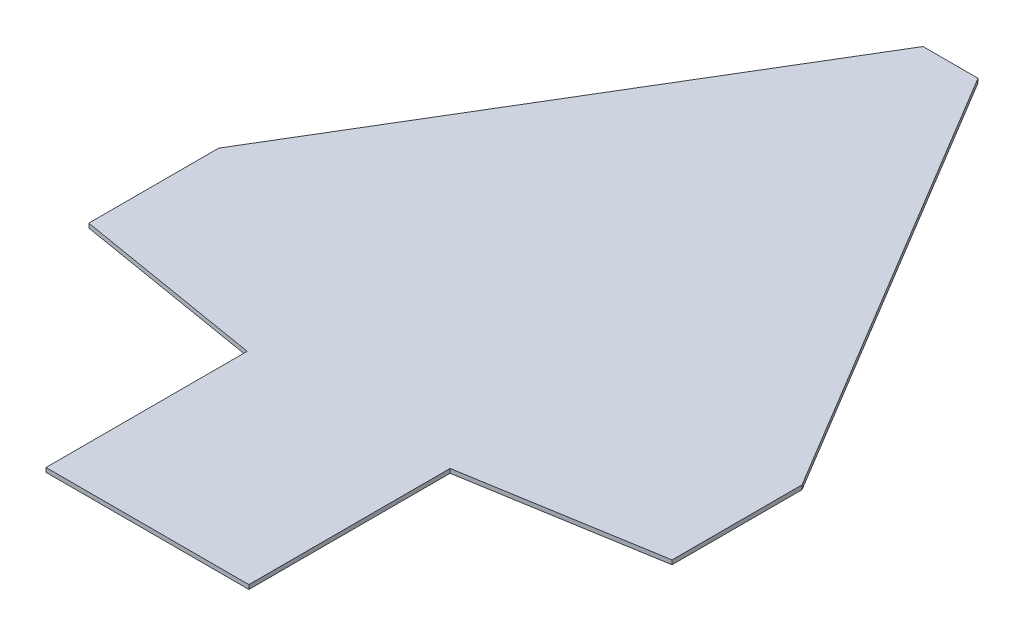
ISO-10303-21;
HEADER;
FILE_DESCRIPTION(('STEP AP214'),'2;1');
FILE_NAME('part.step','',(''),(''),'','','');
FILE_SCHEMA(('AUTOMOTIVE_DESIGN { 1 0 10303 214 1 1 1 1 }'));
ENDSEC;
DATA;
#1=APPLICATION_CONTEXT('core data for automotive mechanical design processes');
#2=APPLICATION_PROTOCOL_DEFINITION('international standard','automotive_design',2000,#1);
#3=PRODUCT_CONTEXT('',#1,'mechanical');
#4=PRODUCT('Part','Part','',(#3));
#5=PRODUCT_RELATED_PRODUCT_CATEGORY('part','',(#4));
#6=PRODUCT_DEFINITION_FORMATION('','',#4);
#7=PRODUCT_DEFINITION_CONTEXT('part definition',#1,'design');
#8=PRODUCT_DEFINITION('design','',#6,#7);
#9=PRODUCT_DEFINITION_SHAPE('','',#8);
#10=(LENGTH_UNIT() NAMED_UNIT(*) SI_UNIT(.MILLI.,.METRE.));
#11=(NAMED_UNIT(*) PLANE_ANGLE_UNIT() SI_UNIT($,.RADIAN.));
#12=(NAMED_UNIT(*) SI_UNIT($,.STERADIAN.) SOLID_ANGLE_UNIT());
#13=UNCERTAINTY_MEASURE_WITH_UNIT(LENGTH_MEASURE(1.E-05),#10,'distance_accuracy_value','');
#14=(GEOMETRIC_REPRESENTATION_CONTEXT(3) GLOBAL_UNCERTAINTY_ASSIGNED_CONTEXT((#13)) GLOBAL_UNIT_ASSIGNED_CONTEXT((#10,
#11,#12)) REPRESENTATION_CONTEXT('',''));
#15=CARTESIAN_POINT('',(0.,0.,0.));
#16=DIRECTION('',(0.,0.,1.));
#17=DIRECTION('',(1.,0.,0.));
#18=AXIS2_PLACEMENT_3D('',#15,#16,#17);
#19=CARTESIAN_POINT('',(47.705339776797,2.54,285.597940839445));
#20=DIRECTION('',(0.164754096556276,0.,0.986334673256459));
#21=DIRECTION('',(0.986334673256459,0.,-0.164754096556276));
#22=AXIS2_PLACEMENT_3D('',#19,#20,#21);
#23=PLANE('',#22);
#24=DIRECTION('',(-0.986334673256459,0.,0.164754096556276));
#25=VECTOR('',#24,1.);
#26=CARTESIAN_POINT('',(47.705339776797,0.,285.597940839445));
#27=LINE('',#26,#25);
#28=CARTESIAN_POINT('',(198.676970487061,0.,260.38013668259));
#29=VERTEX_POINT('',#28);
#30=CARTESIAN_POINT('',(84.3769704870607,0.,279.472432377933));
#31=VERTEX_POINT('',#30);
#32=EDGE_CURVE('E139',#29,#31,#27,.T.);
#33=ORIENTED_EDGE('',*,*,#32,.F.);
#34=DIRECTION('',(0.,-1.,0.));
#35=VECTOR('',#34,1.);
#36=CARTESIAN_POINT('',(198.676970487061,2.54,260.38013668259));
#37=LINE('',#36,#35);
#38=CARTESIAN_POINT('',(198.676970487061,2.54,260.38013668259));
#39=VERTEX_POINT('',#38);
#40=EDGE_CURVE('E11',#39,#29,#37,.T.);
#41=ORIENTED_EDGE('',*,*,#40,.F.);
#42=DIRECTION('',(-0.986334673256459,0.,0.164754096556276));
#43=VECTOR('',#42,1.);
#44=CARTESIAN_POINT('',(47.705339776797,2.54,285.597940839445));
#45=LINE('',#44,#43);
#46=CARTESIAN_POINT('',(84.3769704870607,2.54,279.472432377933));
#47=VERTEX_POINT('',#46);
#48=EDGE_CURVE('E160',#39,#47,#45,.T.);
#49=ORIENTED_EDGE('',*,*,#48,.T.);
#50=DIRECTION('',(0.,-1.,0.));
#51=VECTOR('',#50,1.);
#52=CARTESIAN_POINT('',(84.3769704870607,2.54,279.472432377933));
#53=LINE('',#52,#51);
#54=EDGE_CURVE('E92',#47,#31,#53,.T.);
#55=ORIENTED_EDGE('',*,*,#54,.T.);
#56=EDGE_LOOP('',(#33,#41,#49,#55));
#57=FACE_BOUND('',#56,.T.);
#58=ADVANCED_FACE('F35',(#57),#23,.T.);
#59=CARTESIAN_POINT('',(198.676970487061,2.54,0.));
#60=DIRECTION('',(1.,0.,0.));
#61=DIRECTION('',(0.,0.,-1.));
#62=AXIS2_PLACEMENT_3D('',#59,#60,#61);
#63=PLANE('',#62);
#64=DIRECTION('',(0.,0.,1.));
#65=VECTOR('',#64,1.);
#66=CARTESIAN_POINT('',(198.676970487061,0.,0.));
#67=LINE('',#66,#65);
#68=CARTESIAN_POINT('',(198.676970487061,0.,182.285067862871));
#69=VERTEX_POINT('',#68);
#70=EDGE_CURVE('E142',#69,#29,#67,.T.);
#71=ORIENTED_EDGE('',*,*,#70,.F.);
#72=DIRECTION('',(0.,-1.,0.));
#73=VECTOR('',#72,1.);
#74=CARTESIAN_POINT('',(198.676970487061,2.54,182.285067862871));
#75=LINE('',#74,#73);
#76=CARTESIAN_POINT('',(198.676970487061,2.54,182.285067862871));
#77=VERTEX_POINT('',#76);
#78=EDGE_CURVE('E43',#77,#69,#75,.T.);
#79=ORIENTED_EDGE('',*,*,#78,.F.);
#80=DIRECTION('',(0.,0.,1.));
#81=VECTOR('',#80,1.);
#82=CARTESIAN_POINT('',(198.676970487061,2.54,0.));
#83=LINE('',#82,#81);
#84=EDGE_CURVE('E207',#77,#39,#83,.T.);
#85=ORIENTED_EDGE('',*,*,#84,.T.);
#86=ORIENTED_EDGE('',*,*,#40,.T.);
#87=EDGE_LOOP('',(#71,#79,#85,#86));
#88=FACE_BOUND('',#87,.T.);
#89=ADVANCED_FACE('F184',(#88),#63,.T.);
#90=CARTESIAN_POINT('',(65.6405475472881,2.54,-39.3930747619098));
#91=DIRECTION('',(0.857442517454998,0.,-0.514579759862779));
#92=DIRECTION('',(-0.514579759862779,0.,-0.857442517454998));
#93=AXIS2_PLACEMENT_3D('',#90,#91,#92);
#94=PLANE('',#93);
#95=DIRECTION('',(0.514579759862779,0.,0.857442517454998));
#96=VECTOR('',#95,1.);
#97=CARTESIAN_POINT('',(65.6405475472881,0.,-39.3930747619098));
#98=LINE('',#97,#96);
#99=CARTESIAN_POINT('',(39.9425049405119,0.,-82.213636441786));
#100=VERTEX_POINT('',#99);
#101=EDGE_CURVE('E145',#100,#69,#98,.T.);
#102=ORIENTED_EDGE('',*,*,#101,.F.);
#103=DIRECTION('',(0.,-1.,0.));
#104=VECTOR('',#103,1.);
#105=CARTESIAN_POINT('',(39.9425049405119,2.54,-82.213636441786));
#106=LINE('',#105,#104);
#107=CARTESIAN_POINT('',(39.9425049405119,2.54,-82.213636441786));
#108=VERTEX_POINT('',#107);
#109=EDGE_CURVE('E173',#108,#100,#106,.T.);
#110=ORIENTED_EDGE('',*,*,#109,.F.);
#111=DIRECTION('',(0.514579759862779,0.,0.857442517454998));
#112=VECTOR('',#111,1.);
#113=CARTESIAN_POINT('',(65.6405475472881,2.54,-39.3930747619098));
#114=LINE('',#113,#112);
#115=EDGE_CURVE('E180',#108,#77,#114,.T.);
#116=ORIENTED_EDGE('',*,*,#115,.T.);
#117=ORIENTED_EDGE('',*,*,#78,.T.);
#118=EDGE_LOOP('',(#102,#110,#116,#117));
#119=FACE_BOUND('',#118,.T.);
#120=ADVANCED_FACE('F178',(#119),#94,.T.);
#121=CARTESIAN_POINT('',(0.,2.54,-82.213636441786));
#122=DIRECTION('',(0.,0.,1.));
#123=DIRECTION('',(1.,0.,0.));
#124=AXIS2_PLACEMENT_3D('',#121,#122,#123);
#125=PLANE('',#124);
#126=DIRECTION('',(-1.,0.,0.));
#127=VECTOR('',#126,1.);
#128=CARTESIAN_POINT('',(0.,0.,-82.213636441786));
#129=LINE('',#128,#127);
#130=CARTESIAN_POINT('',(6.89143603360986,0.,-82.213636441786));
#131=VERTEX_POINT('',#130);
#132=EDGE_CURVE('E148',#100,#131,#129,.T.);
#133=ORIENTED_EDGE('',*,*,#132,.T.);
#134=DIRECTION('',(0.,-1.,0.));
#135=VECTOR('',#134,1.);
#136=CARTESIAN_POINT('',(6.89143603360986,2.54,-82.213636441786));
#137=LINE('',#136,#135);
#138=CARTESIAN_POINT('',(6.89143603360986,2.54,-82.213636441786));
#139=VERTEX_POINT('',#138);
#140=EDGE_CURVE('E170',#139,#131,#137,.T.);
#141=ORIENTED_EDGE('',*,*,#140,.F.);
#142=DIRECTION('',(-1.,0.,0.));
#143=VECTOR('',#142,1.);
#144=CARTESIAN_POINT('',(0.,2.54,-82.213636441786));
#145=LINE('',#144,#143);
#146=EDGE_CURVE('E201',#108,#139,#145,.T.);
#147=ORIENTED_EDGE('',*,*,#146,.F.);
#148=ORIENTED_EDGE('',*,*,#109,.T.);
#149=EDGE_LOOP('',(#133,#141,#147,#148));
#150=FACE_BOUND('',#149,.T.);
#151=ADVANCED_FACE('F192',(#150),#125,.F.);
#152=CARTESIAN_POINT('',(-31.2078748921507,2.54,-18.7288832089832));
#153=DIRECTION('',(0.857442517454988,0.,0.514579759862795));
#154=DIRECTION('',(0.514579759862795,0.,-0.857442517454988));
#155=AXIS2_PLACEMENT_3D('',#152,#153,#154);
#156=PLANE('',#155);
#157=DIRECTION('',(-0.514579759862795,0.,0.857442517454988));
#158=VECTOR('',#157,1.);
#159=CARTESIAN_POINT('',(-31.2078748921507,0.,-18.7288832089832));
#160=LINE('',#159,#158);
#161=CARTESIAN_POINT('',(-151.843029512937,0.,182.285067862856));
#162=VERTEX_POINT('',#161);
#163=EDGE_CURVE('E150',#131,#162,#160,.T.);
#164=ORIENTED_EDGE('',*,*,#163,.T.);
#165=DIRECTION('',(0.,-1.,0.));
#166=VECTOR('',#165,1.);
#167=CARTESIAN_POINT('',(-151.843029512937,2.54,182.285067862856));
#168=LINE('',#167,#166);
#169=CARTESIAN_POINT('',(-151.843029512937,2.54,182.285067862856));
#170=VERTEX_POINT('',#169);
#171=EDGE_CURVE('E167',#170,#162,#168,.T.);
#172=ORIENTED_EDGE('',*,*,#171,.F.);
#173=DIRECTION('',(-0.514579759862795,0.,0.857442517454988));
#174=VECTOR('',#173,1.);
#175=CARTESIAN_POINT('',(-31.2078748921507,2.54,-18.7288832089832));
#176=LINE('',#175,#174);
#177=EDGE_CURVE('E198',#139,#170,#176,.T.);
#178=ORIENTED_EDGE('',*,*,#177,.F.);
#179=ORIENTED_EDGE('',*,*,#140,.T.);
#180=EDGE_LOOP('',(#164,#172,#178,#179));
#181=FACE_BOUND('',#180,.T.);
#182=ADVANCED_FACE('F196',(#181),#156,.F.);
#183=CARTESIAN_POINT('',(-151.843029512937,2.54,0.));
#184=DIRECTION('',(1.,0.,0.));
#185=DIRECTION('',(0.,0.,-1.));
#186=AXIS2_PLACEMENT_3D('',#183,#184,#185);
#187=PLANE('',#186);
#188=DIRECTION('',(0.,0.,1.));
#189=VECTOR('',#188,1.);
#190=CARTESIAN_POINT('',(-151.843029512937,0.,0.));
#191=LINE('',#190,#189);
#192=CARTESIAN_POINT('',(-151.843029512937,0.,260.380136682578));
#193=VERTEX_POINT('',#192);
#194=EDGE_CURVE('E152',#162,#193,#191,.T.);
#195=ORIENTED_EDGE('',*,*,#194,.T.);
#196=DIRECTION('',(0.,-1.,0.));
#197=VECTOR('',#196,1.);
#198=CARTESIAN_POINT('',(-151.843029512937,2.54,260.380136682578));
#199=LINE('',#198,#197);
#200=CARTESIAN_POINT('',(-151.843029512937,2.54,260.380136682578));
#201=VERTEX_POINT('',#200);
#202=EDGE_CURVE('E164',#201,#193,#199,.T.);
#203=ORIENTED_EDGE('',*,*,#202,.F.);
#204=DIRECTION('',(0.,0.,1.));
#205=VECTOR('',#204,1.);
#206=CARTESIAN_POINT('',(-151.843029512937,2.54,0.));
#207=LINE('',#206,#205);
#208=EDGE_CURVE('E200',#170,#201,#207,.T.);
#209=ORIENTED_EDGE('',*,*,#208,.F.);
#210=ORIENTED_EDGE('',*,*,#171,.T.);
#211=EDGE_LOOP('',(#195,#203,#209,#210));
#212=FACE_BOUND('',#211,.T.);
#213=ADVANCED_FACE('F222',(#212),#187,.F.);
#214=CARTESIAN_POINT('',(-46.4340833888578,2.54,277.987300010108));
#215=DIRECTION('',(0.164754096556375,0.,-0.986334673256442));
#216=DIRECTION('',(-0.986334673256442,0.,-0.164754096556375));
#217=AXIS2_PLACEMENT_3D('',#214,#215,#216);
#218=PLANE('',#217);
#219=DIRECTION('',(0.986334673256442,0.,0.164754096556375));
#220=VECTOR('',#219,1.);
#221=CARTESIAN_POINT('',(-46.4340833888578,0.,277.987300010108));
#222=LINE('',#221,#220);
#223=CARTESIAN_POINT('',(-37.5430295129392,0.,279.472432377933));
#224=VERTEX_POINT('',#223);
#225=EDGE_CURVE('E154',#193,#224,#222,.T.);
#226=ORIENTED_EDGE('',*,*,#225,.T.);
#227=DIRECTION('',(0.,-1.,0.));
#228=VECTOR('',#227,1.);
#229=CARTESIAN_POINT('',(-37.5430295129392,2.54,279.472432377933));
#230=LINE('',#229,#228);
#231=CARTESIAN_POINT('',(-37.5430295129392,2.54,279.472432377933));
#232=VERTEX_POINT('',#231);
#233=EDGE_CURVE('E131',#232,#224,#230,.T.);
#234=ORIENTED_EDGE('',*,*,#233,.F.);
#235=DIRECTION('',(0.986334673256442,0.,0.164754096556375));
#236=VECTOR('',#235,1.);
#237=CARTESIAN_POINT('',(-46.4340833888578,2.54,277.987300010108));
#238=LINE('',#237,#236);
#239=EDGE_CURVE('E122',#201,#232,#238,.T.);
#240=ORIENTED_EDGE('',*,*,#239,.F.);
#241=ORIENTED_EDGE('',*,*,#202,.T.);
#242=EDGE_LOOP('',(#226,#234,#240,#241));
#243=FACE_BOUND('',#242,.T.);
#244=ADVANCED_FACE('F225',(#243),#218,.F.);
#245=CARTESIAN_POINT('',(-37.5430295129392,2.54,0.));
#246=DIRECTION('',(1.,0.,0.));
#247=DIRECTION('',(0.,0.,-1.));
#248=AXIS2_PLACEMENT_3D('',#245,#246,#247);
#249=PLANE('',#248);
#250=DIRECTION('',(0.,0.,1.));
#251=VECTOR('',#250,1.);
#252=CARTESIAN_POINT('',(-37.5430295129392,0.,0.));
#253=LINE('',#252,#251);
#254=CARTESIAN_POINT('',(-37.5430295129392,0.,400.386363558214));
#255=VERTEX_POINT('',#254);
#256=EDGE_CURVE('E130',#224,#255,#253,.T.);
#257=ORIENTED_EDGE('',*,*,#256,.T.);
#258=DIRECTION('',(0.,-1.,0.));
#259=VECTOR('',#258,1.);
#260=CARTESIAN_POINT('',(-37.5430295129392,2.54,400.386363558214));
#261=LINE('',#260,#259);
#262=CARTESIAN_POINT('',(-37.5430295129392,2.54,400.386363558214));
#263=VERTEX_POINT('',#262);
#264=EDGE_CURVE('E127',#263,#255,#261,.T.);
#265=ORIENTED_EDGE('',*,*,#264,.F.);
#266=DIRECTION('',(0.,0.,1.));
#267=VECTOR('',#266,1.);
#268=CARTESIAN_POINT('',(-37.5430295129392,2.54,0.));
#269=LINE('',#268,#267);
#270=EDGE_CURVE('E116',#232,#263,#269,.T.);
#271=ORIENTED_EDGE('',*,*,#270,.F.);
#272=ORIENTED_EDGE('',*,*,#233,.T.);
#273=EDGE_LOOP('',(#257,#265,#271,#272));
#274=FACE_BOUND('',#273,.T.);
#275=ADVANCED_FACE('F128',(#274),#249,.F.);
#276=CARTESIAN_POINT('',(0.,2.54,400.386363558214));
#277=DIRECTION('',(0.,0.,-1.));
#278=DIRECTION('',(-1.,0.,0.));
#279=AXIS2_PLACEMENT_3D('',#276,#277,#278);
#280=PLANE('',#279);
#281=DIRECTION('',(1.,0.,0.));
#282=VECTOR('',#281,1.);
#283=CARTESIAN_POINT('',(0.,0.,400.386363558214));
#284=LINE('',#283,#282);
#285=CARTESIAN_POINT('',(84.3769704870607,0.,400.386363558214));
#286=VERTEX_POINT('',#285);
#287=EDGE_CURVE('E85',#255,#286,#284,.T.);
#288=ORIENTED_EDGE('',*,*,#287,.T.);
#289=DIRECTION('',(0.,-1.,0.));
#290=VECTOR('',#289,1.);
#291=CARTESIAN_POINT('',(84.3769704870607,2.54,400.386363558214));
#292=LINE('',#291,#290);
#293=CARTESIAN_POINT('',(84.3769704870607,2.54,400.386363558214));
#294=VERTEX_POINT('',#293);
#295=EDGE_CURVE('E132',#294,#286,#292,.T.);
#296=ORIENTED_EDGE('',*,*,#295,.F.);
#297=DIRECTION('',(1.,0.,0.));
#298=VECTOR('',#297,1.);
#299=CARTESIAN_POINT('',(0.,2.54,400.386363558214));
#300=LINE('',#299,#298);
#301=EDGE_CURVE('E120',#263,#294,#300,.T.);
#302=ORIENTED_EDGE('',*,*,#301,.F.);
#303=ORIENTED_EDGE('',*,*,#264,.T.);
#304=EDGE_LOOP('',(#288,#296,#302,#303));
#305=FACE_BOUND('',#304,.T.);
#306=ADVANCED_FACE('F134',(#305),#280,.F.);
#307=CARTESIAN_POINT('',(84.3769704870607,2.54,0.));
#308=DIRECTION('',(-1.,0.,0.));
#309=DIRECTION('',(0.,0.,1.));
#310=AXIS2_PLACEMENT_3D('',#307,#308,#309);
#311=PLANE('',#310);
#312=DIRECTION('',(0.,0.,-1.));
#313=VECTOR('',#312,1.);
#314=CARTESIAN_POINT('',(84.3769704870607,0.,0.));
#315=LINE('',#314,#313);
#316=EDGE_CURVE('E158',#286,#31,#315,.T.);
#317=ORIENTED_EDGE('',*,*,#316,.T.);
#318=ORIENTED_EDGE('',*,*,#54,.F.);
#319=DIRECTION('',(0.,0.,-1.));
#320=VECTOR('',#319,1.);
#321=CARTESIAN_POINT('',(84.3769704870607,2.54,0.));
#322=LINE('',#321,#320);
#323=EDGE_CURVE('E51',#294,#47,#322,.T.);
#324=ORIENTED_EDGE('',*,*,#323,.F.);
#325=ORIENTED_EDGE('',*,*,#295,.T.);
#326=EDGE_LOOP('',(#317,#318,#324,#325));
#327=FACE_BOUND('',#326,.T.);
#328=ADVANCED_FACE('F234',(#327),#311,.F.);
#329=CARTESIAN_POINT('',(0.,2.54,0.));
#330=DIRECTION('',(0.,1.,0.));
#331=DIRECTION('',(0.,0.,1.));
#332=AXIS2_PLACEMENT_3D('',#329,#330,#331);
#333=PLANE('',#332);
#334=ORIENTED_EDGE('',*,*,#48,.F.);
#335=ORIENTED_EDGE('',*,*,#84,.F.);
#336=ORIENTED_EDGE('',*,*,#115,.F.);
#337=ORIENTED_EDGE('',*,*,#146,.T.);
#338=ORIENTED_EDGE('',*,*,#177,.T.);
#339=ORIENTED_EDGE('',*,*,#208,.T.);
#340=ORIENTED_EDGE('',*,*,#239,.T.);
#341=ORIENTED_EDGE('',*,*,#270,.T.);
#342=ORIENTED_EDGE('',*,*,#301,.T.);
#343=ORIENTED_EDGE('',*,*,#323,.T.);
#344=EDGE_LOOP('',(#334,#335,#336,#337,#338,#339,#340,#341,#342,#343));
#345=FACE_BOUND('',#344,.T.);
#346=ADVANCED_FACE('F118',(#345),#333,.T.);
#347=CARTESIAN_POINT('',(0.,0.,0.));
#348=DIRECTION('',(0.,1.,0.));
#349=DIRECTION('',(0.,0.,1.));
#350=AXIS2_PLACEMENT_3D('',#347,#348,#349);
#351=PLANE('',#350);
#352=ORIENTED_EDGE('',*,*,#32,.T.);
#353=ORIENTED_EDGE('',*,*,#316,.F.);
#354=ORIENTED_EDGE('',*,*,#287,.F.);
#355=ORIENTED_EDGE('',*,*,#256,.F.);
#356=ORIENTED_EDGE('',*,*,#225,.F.);
#357=ORIENTED_EDGE('',*,*,#194,.F.);
#358=ORIENTED_EDGE('',*,*,#163,.F.);
#359=ORIENTED_EDGE('',*,*,#132,.F.);
#360=ORIENTED_EDGE('',*,*,#101,.T.);
#361=ORIENTED_EDGE('',*,*,#70,.T.);
#362=EDGE_LOOP('',(#352,#353,#354,#355,#356,#357,#358,#359,#360,#361));
#363=FACE_BOUND('',#362,.T.);
#364=ADVANCED_FACE('F187',(#363),#351,.F.);
#365=CLOSED_SHELL('',(#58,#89,#120,#151,#182,#213,#244,#275,#306,#328,#346,#364));
#366=MANIFOLD_SOLID_BREP('B2',#365);
#367=ADVANCED_BREP_SHAPE_REPRESENTATION('',(#18,#366),#14);
#368=SHAPE_DEFINITION_REPRESENTATION(#9,#367);
ENDSEC;
END-ISO-10303-21;
